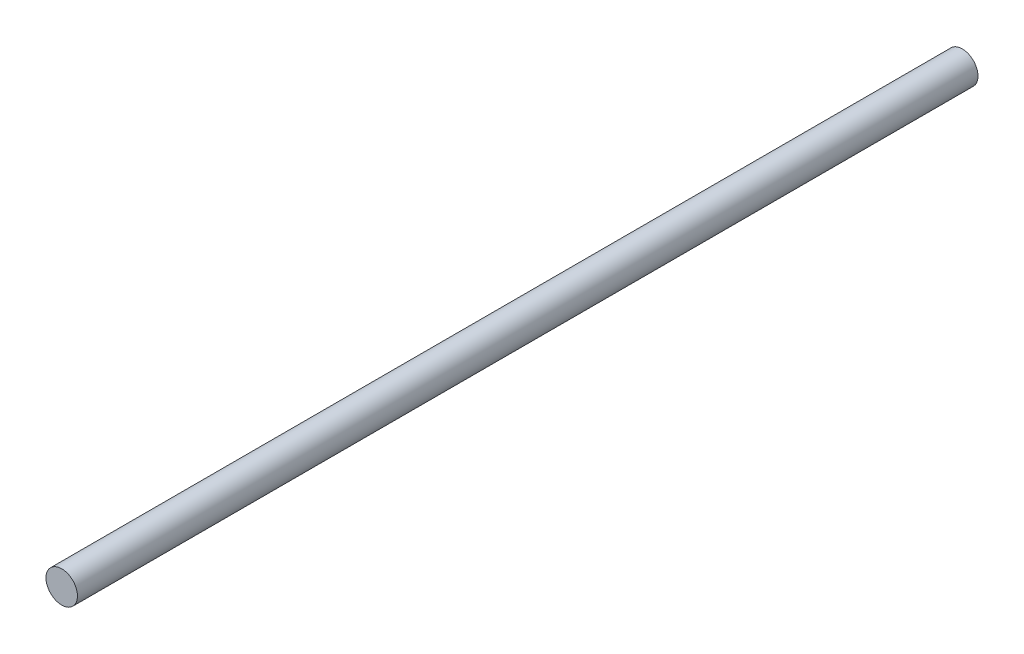
ISO-10303-21;
HEADER;
FILE_DESCRIPTION(('STEP AP214'),'2;1');
FILE_NAME('part.step','',(''),(''),'','','');
FILE_SCHEMA(('AUTOMOTIVE_DESIGN { 1 0 10303 214 1 1 1 1 }'));
ENDSEC;
DATA;
#1=APPLICATION_CONTEXT('core data for automotive mechanical design processes');
#2=APPLICATION_PROTOCOL_DEFINITION('international standard','automotive_design',2000,#1);
#3=PRODUCT_CONTEXT('',#1,'mechanical');
#4=PRODUCT('Part','Part','',(#3));
#5=PRODUCT_RELATED_PRODUCT_CATEGORY('part','',(#4));
#6=PRODUCT_DEFINITION_FORMATION('','',#4);
#7=PRODUCT_DEFINITION_CONTEXT('part definition',#1,'design');
#8=PRODUCT_DEFINITION('design','',#6,#7);
#9=PRODUCT_DEFINITION_SHAPE('','',#8);
#10=(LENGTH_UNIT() NAMED_UNIT(*) SI_UNIT(.MILLI.,.METRE.));
#11=(NAMED_UNIT(*) PLANE_ANGLE_UNIT() SI_UNIT($,.RADIAN.));
#12=(NAMED_UNIT(*) SI_UNIT($,.STERADIAN.) SOLID_ANGLE_UNIT());
#13=UNCERTAINTY_MEASURE_WITH_UNIT(LENGTH_MEASURE(1.E-05),#10,'distance_accuracy_value','');
#14=(GEOMETRIC_REPRESENTATION_CONTEXT(3) GLOBAL_UNCERTAINTY_ASSIGNED_CONTEXT((#13)) GLOBAL_UNIT_ASSIGNED_CONTEXT((#10,
#11,#12)) REPRESENTATION_CONTEXT('',''));
#15=CARTESIAN_POINT('',(0.,0.,0.));
#16=DIRECTION('',(0.,0.,1.));
#17=DIRECTION('',(1.,0.,0.));
#18=AXIS2_PLACEMENT_3D('',#15,#16,#17);
#19=CARTESIAN_POINT('',(0.,0.,286.));
#20=DIRECTION('',(0.,0.,-1.));
#21=DIRECTION('',(-1.,0.,0.));
#22=AXIS2_PLACEMENT_3D('',#19,#20,#21);
#23=CYLINDRICAL_SURFACE('',#22,5.);
#24=CARTESIAN_POINT('',(0.,0.,286.));
#25=DIRECTION('',(0.,0.,1.));
#26=DIRECTION('',(1.,0.,0.));
#27=AXIS2_PLACEMENT_3D('',#24,#25,#26);
#28=CIRCLE('',#27,5.);
#29=CARTESIAN_POINT('',(5.,0.,286.));
#30=VERTEX_POINT('',#29);
#31=EDGE_CURVE('E10',#30,#30,#28,.T.);
#32=ORIENTED_EDGE('',*,*,#31,.F.);
#33=EDGE_LOOP('',(#32));
#34=FACE_BOUND('',#33,.T.);
#35=CARTESIAN_POINT('',(0.,0.,0.));
#36=DIRECTION('',(0.,0.,1.));
#37=DIRECTION('',(1.,0.,0.));
#38=AXIS2_PLACEMENT_3D('',#35,#36,#37);
#39=CIRCLE('',#38,5.);
#40=CARTESIAN_POINT('',(5.,0.,0.));
#41=VERTEX_POINT('',#40);
#42=EDGE_CURVE('E44',#41,#41,#39,.T.);
#43=ORIENTED_EDGE('',*,*,#42,.T.);
#44=EDGE_LOOP('',(#43));
#45=FACE_BOUND('',#44,.T.);
#46=ADVANCED_FACE('F41',(#34,#45),#23,.T.);
#47=CARTESIAN_POINT('',(0.,0.,286.));
#48=DIRECTION('',(0.,0.,1.));
#49=DIRECTION('',(1.,0.,0.));
#50=AXIS2_PLACEMENT_3D('',#47,#48,#49);
#51=PLANE('',#50);
#52=ORIENTED_EDGE('',*,*,#31,.T.);
#53=EDGE_LOOP('',(#52));
#54=FACE_BOUND('',#53,.T.);
#55=ADVANCED_FACE('F56',(#54),#51,.T.);
#56=CARTESIAN_POINT('',(0.,0.,0.));
#57=DIRECTION('',(0.,0.,1.));
#58=DIRECTION('',(1.,0.,0.));
#59=AXIS2_PLACEMENT_3D('',#56,#57,#58);
#60=PLANE('',#59);
#61=ORIENTED_EDGE('',*,*,#42,.F.);
#62=EDGE_LOOP('',(#61));
#63=FACE_BOUND('',#62,.T.);
#64=ADVANCED_FACE('F54',(#63),#60,.F.);
#65=CLOSED_SHELL('',(#46,#55,#64));
#66=MANIFOLD_SOLID_BREP('B2',#65);
#67=ADVANCED_BREP_SHAPE_REPRESENTATION('',(#18,#66),#14);
#68=SHAPE_DEFINITION_REPRESENTATION(#9,#67);
ENDSEC;
END-ISO-10303-21;
